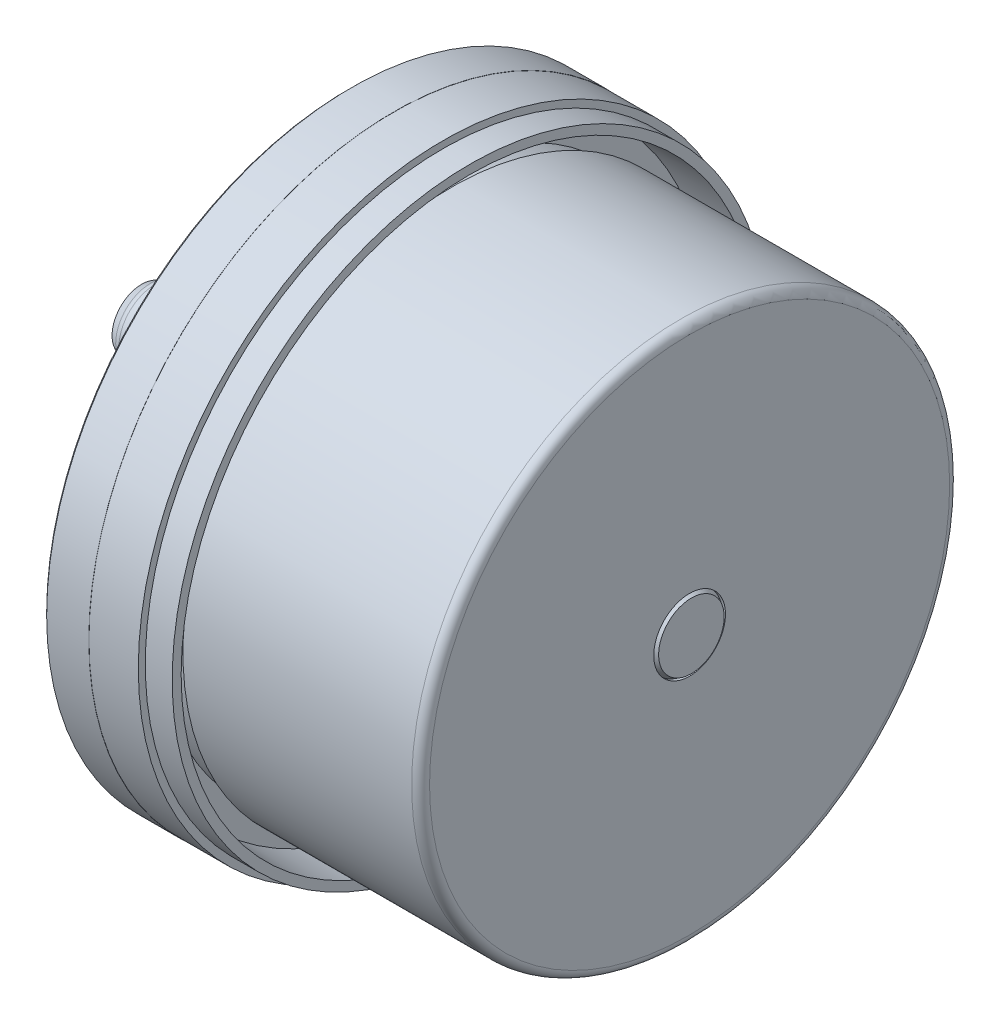
ISO-10303-21;
HEADER;
FILE_DESCRIPTION(('STEP AP214'),'2;1');
FILE_NAME('part.step','',(''),(''),'','','');
FILE_SCHEMA(('AUTOMOTIVE_DESIGN { 1 0 10303 214 1 1 1 1 }'));
ENDSEC;
DATA;
#1=APPLICATION_CONTEXT('core data for automotive mechanical design processes');
#2=APPLICATION_PROTOCOL_DEFINITION('international standard','automotive_design',2000,#1);
#3=PRODUCT_CONTEXT('',#1,'mechanical');
#4=PRODUCT('Part','Part','',(#3));
#5=PRODUCT_RELATED_PRODUCT_CATEGORY('part','',(#4));
#6=PRODUCT_DEFINITION_FORMATION('','',#4);
#7=PRODUCT_DEFINITION_CONTEXT('part definition',#1,'design');
#8=PRODUCT_DEFINITION('design','',#6,#7);
#9=PRODUCT_DEFINITION_SHAPE('','',#8);
#10=(LENGTH_UNIT() NAMED_UNIT(*) SI_UNIT(.MILLI.,.METRE.));
#11=(NAMED_UNIT(*) PLANE_ANGLE_UNIT() SI_UNIT($,.RADIAN.));
#12=(NAMED_UNIT(*) SI_UNIT($,.STERADIAN.) SOLID_ANGLE_UNIT());
#13=UNCERTAINTY_MEASURE_WITH_UNIT(LENGTH_MEASURE(1.E-05),#10,'distance_accuracy_value','');
#14=(GEOMETRIC_REPRESENTATION_CONTEXT(3) GLOBAL_UNCERTAINTY_ASSIGNED_CONTEXT((#13)) GLOBAL_UNIT_ASSIGNED_CONTEXT((#10,
#11,#12)) REPRESENTATION_CONTEXT('',''));
#15=CARTESIAN_POINT('',(0.,0.,0.));
#16=DIRECTION('',(0.,0.,1.));
#17=DIRECTION('',(1.,0.,0.));
#18=AXIS2_PLACEMENT_3D('',#15,#16,#17);
#19=CARTESIAN_POINT('',(-21.8999999999602,-8.96647078790032E-12,0.));
#20=DIRECTION('',(1.,0.,0.));
#21=DIRECTION('',(0.,0.,-1.));
#22=AXIS2_PLACEMENT_3D('',#19,#20,#21);
#23=CONICAL_SURFACE('',#22,4.00000000000897,0.523598775598299);
#24=CARTESIAN_POINT('',(-22.1320508075291,-8.96647078790032E-12,0.));
#25=DIRECTION('',(-1.,0.,0.));
#26=DIRECTION('',(0.,0.,1.));
#27=AXIS2_PLACEMENT_3D('',#24,#25,#26);
#28=CIRCLE('',#27,3.86602540379341);
#29=CARTESIAN_POINT('',(-22.1320508075291,-8.96647078790032E-12,3.86602540379341));
#30=VERTEX_POINT('',#29);
#31=EDGE_CURVE('E13',#30,#30,#28,.T.);
#32=ORIENTED_EDGE('',*,*,#31,.T.);
#33=EDGE_LOOP('',(#32));
#34=FACE_BOUND('',#33,.T.);
#35=CARTESIAN_POINT('',(-23.0999999999374,-8.96647078790032E-12,0.));
#36=DIRECTION('',(1.,0.,0.));
#37=DIRECTION('',(0.,0.,-1.));
#38=AXIS2_PLACEMENT_3D('',#35,#36,#37);
#39=CIRCLE('',#38,3.30717967699457);
#40=CARTESIAN_POINT('',(-23.0999999999374,-8.96647078790032E-12,-3.30717967699457));
#41=VERTEX_POINT('',#40);
#42=EDGE_CURVE('E131',#41,#41,#39,.T.);
#43=ORIENTED_EDGE('',*,*,#42,.T.);
#44=EDGE_LOOP('',(#43));
#45=FACE_BOUND('',#44,.T.);
#46=ADVANCED_FACE('F44',(#34,#45),#23,.T.);
#47=CARTESIAN_POINT('',(-23.0999999999374,3.3071796769856,0.));
#48=DIRECTION('',(-1.,0.,0.));
#49=DIRECTION('',(0.,0.,1.));
#50=AXIS2_PLACEMENT_3D('',#47,#48,#49);
#51=PLANE('',#50);
#52=ORIENTED_EDGE('',*,*,#42,.F.);
#53=EDGE_LOOP('',(#52));
#54=FACE_BOUND('',#53,.T.);
#55=ADVANCED_FACE('F185',(#54),#51,.T.);
#56=CARTESIAN_POINT('',(38.2000000000212,-8.96647078790032E-12,0.));
#57=DIRECTION('',(1.,0.,0.));
#58=DIRECTION('',(0.,0.,-1.));
#59=AXIS2_PLACEMENT_3D('',#56,#57,#58);
#60=PLANE('',#59);
#61=CARTESIAN_POINT('',(38.2000000000212,-8.96647078790032E-12,0.));
#62=DIRECTION('',(1.,0.,0.));
#63=DIRECTION('',(0.,0.,-1.));
#64=AXIS2_PLACEMENT_3D('',#61,#62,#63);
#65=CIRCLE('',#64,3.65358983848293);
#66=CARTESIAN_POINT('',(38.2000000000212,-8.96647078790032E-12,-3.65358983848293));
#67=VERTEX_POINT('',#66);
#68=EDGE_CURVE('E128',#67,#67,#65,.T.);
#69=ORIENTED_EDGE('',*,*,#68,.T.);
#70=EDGE_LOOP('',(#69));
#71=FACE_BOUND('',#70,.T.);
#72=ADVANCED_FACE('F191',(#71),#60,.T.);
#73=CARTESIAN_POINT('',(38.2000000000212,-8.96647078790032E-12,0.));
#74=DIRECTION('',(-1.,0.,0.));
#75=DIRECTION('',(0.,0.,1.));
#76=AXIS2_PLACEMENT_3D('',#73,#74,#75);
#77=CONICAL_SURFACE('',#76,3.65358983848293,0.52359877559829);
#78=CARTESIAN_POINT('',(37.6,-8.96647078790032E-12,0.));
#79=DIRECTION('',(1.,0.,0.));
#80=DIRECTION('',(0.,0.,-1.));
#81=AXIS2_PLACEMENT_3D('',#78,#79,#80);
#82=CIRCLE('',#81,4.00000000000897);
#83=CARTESIAN_POINT('',(37.6,-8.96647078790032E-12,-4.00000000000897));
#84=VERTEX_POINT('',#83);
#85=EDGE_CURVE('E125',#84,#84,#82,.T.);
#86=ORIENTED_EDGE('',*,*,#85,.T.);
#87=EDGE_LOOP('',(#86));
#88=FACE_BOUND('',#87,.T.);
#89=ORIENTED_EDGE('',*,*,#68,.F.);
#90=EDGE_LOOP('',(#89));
#91=FACE_BOUND('',#90,.T.);
#92=ADVANCED_FACE('F293',(#88,#91),#77,.T.);
#93=CARTESIAN_POINT('',(-23.0999999999374,-8.96647078790032E-12,0.));
#94=DIRECTION('',(1.,0.,0.));
#95=DIRECTION('',(0.,0.,-1.));
#96=AXIS2_PLACEMENT_3D('',#93,#94,#95);
#97=CYLINDRICAL_SURFACE('',#96,4.00000000000897);
#98=CARTESIAN_POINT('',(38.,-8.96647078790032E-12,0.));
#99=DIRECTION('',(1.,0.,0.));
#100=DIRECTION('',(0.,0.,-1.));
#101=AXIS2_PLACEMENT_3D('',#98,#99,#100);
#102=CIRCLE('',#101,4.00000000000897);
#103=CARTESIAN_POINT('',(38.,-8.96647078790032E-12,-4.00000000000897));
#104=VERTEX_POINT('',#103);
#105=EDGE_CURVE('E122',#104,#104,#102,.T.);
#106=ORIENTED_EDGE('',*,*,#105,.T.);
#107=EDGE_LOOP('',(#106));
#108=FACE_BOUND('',#107,.T.);
#109=ORIENTED_EDGE('',*,*,#85,.F.);
#110=EDGE_LOOP('',(#109));
#111=FACE_BOUND('',#110,.T.);
#112=ADVANCED_FACE('F289',(#108,#111),#97,.F.);
#113=CARTESIAN_POINT('',(38.,4.,0.));
#114=DIRECTION('',(1.,0.,0.));
#115=DIRECTION('',(0.,0.,-1.));
#116=AXIS2_PLACEMENT_3D('',#113,#114,#115);
#117=PLANE('',#116);
#118=CARTESIAN_POINT('',(38.,-8.96647078790032E-12,0.));
#119=DIRECTION('',(1.,0.,0.));
#120=DIRECTION('',(0.,0.,-1.));
#121=AXIS2_PLACEMENT_3D('',#118,#119,#120);
#122=CIRCLE('',#121,29.000000000007);
#123=CARTESIAN_POINT('',(38.,-8.96647078790032E-12,-29.000000000007));
#124=VERTEX_POINT('',#123);
#125=EDGE_CURVE('E164',#124,#124,#122,.T.);
#126=ORIENTED_EDGE('',*,*,#125,.T.);
#127=EDGE_LOOP('',(#126));
#128=FACE_BOUND('',#127,.T.);
#129=ORIENTED_EDGE('',*,*,#105,.F.);
#130=EDGE_LOOP('',(#129));
#131=FACE_BOUND('',#130,.T.);
#132=ADVANCED_FACE('F285',(#128,#131),#117,.T.);
#133=CARTESIAN_POINT('',(-23.0999999999374,-8.96647078790032E-12,0.));
#134=DIRECTION('',(1.,0.,0.));
#135=DIRECTION('',(0.,0.,-1.));
#136=AXIS2_PLACEMENT_3D('',#133,#134,#135);
#137=CYLINDRICAL_SURFACE('',#136,30.000000000007);
#138=CARTESIAN_POINT('',(37.,-8.96647078790032E-12,0.));
#139=DIRECTION('',(1.,0.,0.));
#140=DIRECTION('',(0.,0.,-1.));
#141=AXIS2_PLACEMENT_3D('',#138,#139,#140);
#142=CIRCLE('',#141,30.000000000007);
#143=CARTESIAN_POINT('',(37.,-8.96647078790032E-12,-30.000000000007));
#144=VERTEX_POINT('',#143);
#145=EDGE_CURVE('E167',#144,#144,#142,.F.);
#146=ORIENTED_EDGE('',*,*,#145,.T.);
#147=EDGE_LOOP('',(#146));
#148=FACE_BOUND('',#147,.T.);
#149=CARTESIAN_POINT('',(11.5000000000033,-8.96647078790032E-12,0.));
#150=DIRECTION('',(1.,0.,0.));
#151=DIRECTION('',(0.,0.,-1.));
#152=AXIS2_PLACEMENT_3D('',#149,#150,#151);
#153=CIRCLE('',#152,30.000000000007);
#154=CARTESIAN_POINT('',(11.5000000000033,-8.96647078790032E-12,-30.000000000007));
#155=VERTEX_POINT('',#154);
#156=EDGE_CURVE('E119',#155,#155,#153,.T.);
#157=ORIENTED_EDGE('',*,*,#156,.T.);
#158=EDGE_LOOP('',(#157));
#159=FACE_BOUND('',#158,.T.);
#160=ADVANCED_FACE('F281',(#148,#159),#137,.T.);
#161=CARTESIAN_POINT('',(11.5000000000033,29.9999999999981,0.));
#162=DIRECTION('',(-1.,0.,0.));
#163=DIRECTION('',(0.,0.,1.));
#164=AXIS2_PLACEMENT_3D('',#161,#162,#163);
#165=PLANE('',#164);
#166=CARTESIAN_POINT('',(11.5000000000033,-8.96647078790032E-12,0.));
#167=DIRECTION('',(1.,0.,0.));
#168=DIRECTION('',(0.,0.,-1.));
#169=AXIS2_PLACEMENT_3D('',#166,#167,#168);
#170=CIRCLE('',#169,29.000000000007);
#171=CARTESIAN_POINT('',(11.5000000000033,-8.96647078790032E-12,-29.000000000007));
#172=VERTEX_POINT('',#171);
#173=EDGE_CURVE('E116',#172,#172,#170,.T.);
#174=ORIENTED_EDGE('',*,*,#173,.T.);
#175=EDGE_LOOP('',(#174));
#176=FACE_BOUND('',#175,.T.);
#177=ORIENTED_EDGE('',*,*,#156,.F.);
#178=EDGE_LOOP('',(#177));
#179=FACE_BOUND('',#178,.T.);
#180=ADVANCED_FACE('F277',(#176,#179),#165,.T.);
#181=CARTESIAN_POINT('',(-23.0999999999374,-8.96647078790032E-12,0.));
#182=DIRECTION('',(1.,0.,0.));
#183=DIRECTION('',(0.,0.,-1.));
#184=AXIS2_PLACEMENT_3D('',#181,#182,#183);
#185=CYLINDRICAL_SURFACE('',#184,29.000000000007);
#186=CARTESIAN_POINT('',(7.80000000000329,-8.96647078790032E-12,0.));
#187=DIRECTION('',(1.,0.,0.));
#188=DIRECTION('',(0.,0.,-1.));
#189=AXIS2_PLACEMENT_3D('',#186,#187,#188);
#190=CIRCLE('',#189,29.000000000007);
#191=CARTESIAN_POINT('',(7.80000000000329,-8.96647078790032E-12,-29.000000000007));
#192=VERTEX_POINT('',#191);
#193=EDGE_CURVE('E113',#192,#192,#190,.T.);
#194=ORIENTED_EDGE('',*,*,#193,.T.);
#195=EDGE_LOOP('',(#194));
#196=FACE_BOUND('',#195,.T.);
#197=ORIENTED_EDGE('',*,*,#173,.F.);
#198=EDGE_LOOP('',(#197));
#199=FACE_BOUND('',#198,.T.);
#200=ADVANCED_FACE('F273',(#196,#199),#185,.T.);
#201=CARTESIAN_POINT('',(7.80000000000329,28.9999999999981,0.));
#202=DIRECTION('',(1.,0.,0.));
#203=DIRECTION('',(0.,0.,-1.));
#204=AXIS2_PLACEMENT_3D('',#201,#202,#203);
#205=PLANE('',#204);
#206=CARTESIAN_POINT('',(7.80000000000329,-8.96647078790032E-12,0.));
#207=DIRECTION('',(1.,0.,0.));
#208=DIRECTION('',(0.,0.,-1.));
#209=AXIS2_PLACEMENT_3D('',#206,#207,#208);
#210=CIRCLE('',#209,32.0009516139056);
#211=CARTESIAN_POINT('',(7.80000000000329,-8.96647078790032E-12,-32.0009516139056));
#212=VERTEX_POINT('',#211);
#213=EDGE_CURVE('E110',#212,#212,#210,.T.);
#214=ORIENTED_EDGE('',*,*,#213,.T.);
#215=EDGE_LOOP('',(#214));
#216=FACE_BOUND('',#215,.T.);
#217=ORIENTED_EDGE('',*,*,#193,.F.);
#218=EDGE_LOOP('',(#217));
#219=FACE_BOUND('',#218,.T.);
#220=ADVANCED_FACE('F269',(#216,#219),#205,.T.);
#221=CARTESIAN_POINT('',(7.80000000000329,-8.96647078790032E-12,0.));
#222=DIRECTION('',(1.,0.,0.));
#223=DIRECTION('',(0.,0.,-1.));
#224=AXIS2_PLACEMENT_3D('',#221,#222,#223);
#225=CONICAL_SURFACE('',#224,32.0009516139056,0.0349065850398798);
#226=CARTESIAN_POINT('',(13.5000000000032,-8.96647078790032E-12,0.));
#227=DIRECTION('',(1.,0.,0.));
#228=DIRECTION('',(0.,0.,-1.));
#229=AXIS2_PLACEMENT_3D('',#226,#227,#228);
#230=CIRCLE('',#229,32.2000000000085);
#231=CARTESIAN_POINT('',(13.5000000000032,-8.96647078790032E-12,-32.2000000000085));
#232=VERTEX_POINT('',#231);
#233=EDGE_CURVE('E107',#232,#232,#230,.T.);
#234=ORIENTED_EDGE('',*,*,#233,.T.);
#235=EDGE_LOOP('',(#234));
#236=FACE_BOUND('',#235,.T.);
#237=ORIENTED_EDGE('',*,*,#213,.F.);
#238=EDGE_LOOP('',(#237));
#239=FACE_BOUND('',#238,.T.);
#240=ADVANCED_FACE('F265',(#236,#239),#225,.F.);
#241=CARTESIAN_POINT('',(13.5000000000032,32.1999999999995,0.));
#242=DIRECTION('',(1.,0.,0.));
#243=DIRECTION('',(0.,0.,-1.));
#244=AXIS2_PLACEMENT_3D('',#241,#242,#243);
#245=PLANE('',#244);
#246=CARTESIAN_POINT('',(13.5000000000032,-8.96647078790032E-12,0.));
#247=DIRECTION('',(1.,0.,0.));
#248=DIRECTION('',(0.,0.,-1.));
#249=AXIS2_PLACEMENT_3D('',#246,#247,#248);
#250=CIRCLE('',#249,33.200000000007);
#251=CARTESIAN_POINT('',(13.5000000000032,-8.96647078790032E-12,-33.200000000007));
#252=VERTEX_POINT('',#251);
#253=EDGE_CURVE('E104',#252,#252,#250,.T.);
#254=ORIENTED_EDGE('',*,*,#253,.T.);
#255=EDGE_LOOP('',(#254));
#256=FACE_BOUND('',#255,.T.);
#257=ORIENTED_EDGE('',*,*,#233,.F.);
#258=EDGE_LOOP('',(#257));
#259=FACE_BOUND('',#258,.T.);
#260=ADVANCED_FACE('F261',(#256,#259),#245,.T.);
#261=CARTESIAN_POINT('',(-23.0999999999374,-8.96647078790032E-12,0.));
#262=DIRECTION('',(1.,0.,0.));
#263=DIRECTION('',(0.,0.,-1.));
#264=AXIS2_PLACEMENT_3D('',#261,#262,#263);
#265=CYLINDRICAL_SURFACE('',#264,33.200000000007);
#266=CARTESIAN_POINT('',(10.5000000000032,-8.96647078790032E-12,0.));
#267=DIRECTION('',(1.,0.,0.));
#268=DIRECTION('',(0.,0.,-1.));
#269=AXIS2_PLACEMENT_3D('',#266,#267,#268);
#270=CIRCLE('',#269,33.2000000000071);
#271=CARTESIAN_POINT('',(10.5000000000032,-8.96647078790032E-12,-33.2000000000071));
#272=VERTEX_POINT('',#271);
#273=EDGE_CURVE('E101',#272,#272,#270,.T.);
#274=ORIENTED_EDGE('',*,*,#273,.T.);
#275=EDGE_LOOP('',(#274));
#276=FACE_BOUND('',#275,.T.);
#277=ORIENTED_EDGE('',*,*,#253,.F.);
#278=EDGE_LOOP('',(#277));
#279=FACE_BOUND('',#278,.T.);
#280=ADVANCED_FACE('F257',(#276,#279),#265,.T.);
#281=CARTESIAN_POINT('',(10.5000000000032,33.1999999999981,0.));
#282=DIRECTION('',(1.,0.,0.));
#283=DIRECTION('',(0.,0.,-1.));
#284=AXIS2_PLACEMENT_3D('',#281,#282,#283);
#285=PLANE('',#284);
#286=CARTESIAN_POINT('',(10.5000000000032,-8.96647078790032E-12,0.));
#287=DIRECTION('',(1.,0.,0.));
#288=DIRECTION('',(0.,0.,-1.));
#289=AXIS2_PLACEMENT_3D('',#286,#287,#288);
#290=CIRCLE('',#289,33.980000000007);
#291=CARTESIAN_POINT('',(10.5000000000032,-8.96647078790032E-12,-33.980000000007));
#292=VERTEX_POINT('',#291);
#293=EDGE_CURVE('E98',#292,#292,#290,.T.);
#294=ORIENTED_EDGE('',*,*,#293,.T.);
#295=EDGE_LOOP('',(#294));
#296=FACE_BOUND('',#295,.T.);
#297=ORIENTED_EDGE('',*,*,#273,.F.);
#298=EDGE_LOOP('',(#297));
#299=FACE_BOUND('',#298,.T.);
#300=ADVANCED_FACE('F253',(#296,#299),#285,.T.);
#301=CARTESIAN_POINT('',(-23.0999999999374,-8.96647078790032E-12,0.));
#302=DIRECTION('',(1.,0.,0.));
#303=DIRECTION('',(0.,0.,-1.));
#304=AXIS2_PLACEMENT_3D('',#301,#302,#303);
#305=CYLINDRICAL_SURFACE('',#304,33.980000000007);
#306=CARTESIAN_POINT('',(5.00000000000322,-8.96647078790032E-12,0.));
#307=DIRECTION('',(1.,0.,0.));
#308=DIRECTION('',(0.,0.,-1.));
#309=AXIS2_PLACEMENT_3D('',#306,#307,#308);
#310=CIRCLE('',#309,33.980000000007);
#311=CARTESIAN_POINT('',(5.00000000000322,-8.96647078790032E-12,-33.980000000007));
#312=VERTEX_POINT('',#311);
#313=EDGE_CURVE('E95',#312,#312,#310,.T.);
#314=ORIENTED_EDGE('',*,*,#313,.T.);
#315=EDGE_LOOP('',(#314));
#316=FACE_BOUND('',#315,.T.);
#317=ORIENTED_EDGE('',*,*,#293,.F.);
#318=EDGE_LOOP('',(#317));
#319=FACE_BOUND('',#318,.T.);
#320=ADVANCED_FACE('F249',(#316,#319),#305,.T.);
#321=CARTESIAN_POINT('',(5.00000000000322,33.9799999999981,0.));
#322=DIRECTION('',(1.,0.,0.));
#323=DIRECTION('',(0.,0.,-1.));
#324=AXIS2_PLACEMENT_3D('',#321,#322,#323);
#325=PLANE('',#324);
#326=CARTESIAN_POINT('',(5.00000000000322,-8.96647078790032E-12,0.));
#327=DIRECTION('',(1.,0.,0.));
#328=DIRECTION('',(0.,0.,-1.));
#329=AXIS2_PLACEMENT_3D('',#326,#327,#328);
#330=CIRCLE('',#329,34.000000000007);
#331=CARTESIAN_POINT('',(5.00000000000322,-8.96647078790032E-12,-34.000000000007));
#332=VERTEX_POINT('',#331);
#333=EDGE_CURVE('E92',#332,#332,#330,.T.);
#334=ORIENTED_EDGE('',*,*,#333,.T.);
#335=EDGE_LOOP('',(#334));
#336=FACE_BOUND('',#335,.T.);
#337=ORIENTED_EDGE('',*,*,#313,.F.);
#338=EDGE_LOOP('',(#337));
#339=FACE_BOUND('',#338,.T.);
#340=ADVANCED_FACE('F242',(#336,#339),#325,.T.);
#341=CARTESIAN_POINT('',(-23.0999999999374,-8.96647078790032E-12,0.));
#342=DIRECTION('',(1.,0.,0.));
#343=DIRECTION('',(0.,0.,-1.));
#344=AXIS2_PLACEMENT_3D('',#341,#342,#343);
#345=CYLINDRICAL_SURFACE('',#344,34.000000000007);
#346=CARTESIAN_POINT('',(0.300000000003332,-8.96647078790032E-12,0.));
#347=DIRECTION('',(-1.,0.,0.));
#348=DIRECTION('',(0.,0.,1.));
#349=AXIS2_PLACEMENT_3D('',#346,#347,#348);
#350=CIRCLE('',#349,34.000000000007);
#351=CARTESIAN_POINT('',(0.300000000003332,-8.96647078790032E-12,34.000000000007));
#352=VERTEX_POINT('',#351);
#353=EDGE_CURVE('E152',#352,#352,#350,.F.);
#354=ORIENTED_EDGE('',*,*,#353,.T.);
#355=EDGE_LOOP('',(#354));
#356=FACE_BOUND('',#355,.T.);
#357=ORIENTED_EDGE('',*,*,#333,.F.);
#358=EDGE_LOOP('',(#357));
#359=FACE_BOUND('',#358,.T.);
#360=ADVANCED_FACE('F236',(#356,#359),#345,.T.);
#361=CARTESIAN_POINT('',(3.21835627661152E-12,33.9999999999981,0.));
#362=DIRECTION('',(-1.,0.,0.));
#363=DIRECTION('',(0.,0.,1.));
#364=AXIS2_PLACEMENT_3D('',#361,#362,#363);
#365=PLANE('',#364);
#366=CARTESIAN_POINT('',(3.21835627661152E-12,-8.96647078790032E-12,0.));
#367=DIRECTION('',(-1.,0.,0.));
#368=DIRECTION('',(0.,0.,1.));
#369=AXIS2_PLACEMENT_3D('',#366,#367,#368);
#370=CIRCLE('',#369,33.700000000007);
#371=CARTESIAN_POINT('',(3.21835627661152E-12,-8.96647078790032E-12,33.700000000007));
#372=VERTEX_POINT('',#371);
#373=EDGE_CURVE('E155',#372,#372,#370,.T.);
#374=ORIENTED_EDGE('',*,*,#373,.T.);
#375=EDGE_LOOP('',(#374));
#376=FACE_BOUND('',#375,.T.);
#377=CARTESIAN_POINT('',(3.21835627661152E-12,21.5,0.));
#378=DIRECTION('',(-1.,0.,0.));
#379=DIRECTION('',(0.,0.,1.));
#380=AXIS2_PLACEMENT_3D('',#377,#378,#379);
#381=CIRCLE('',#380,2.20000000009175);
#382=CARTESIAN_POINT('',(3.21835627661152E-12,21.5,2.20000000009175));
#383=VERTEX_POINT('',#382);
#384=EDGE_CURVE('E143',#383,#383,#381,.F.);
#385=ORIENTED_EDGE('',*,*,#384,.T.);
#386=EDGE_LOOP('',(#385));
#387=FACE_BOUND('',#386,.T.);
#388=CARTESIAN_POINT('',(3.21835627661152E-12,-10.75,18.61954618137));
#389=DIRECTION('',(-1.,0.,0.));
#390=DIRECTION('',(0.,0.,1.));
#391=AXIS2_PLACEMENT_3D('',#388,#389,#390);
#392=CIRCLE('',#391,2.20000000009175);
#393=CARTESIAN_POINT('',(3.21835627661152E-12,-10.75,20.8195461814618));
#394=VERTEX_POINT('',#393);
#395=EDGE_CURVE('E140',#394,#394,#392,.F.);
#396=ORIENTED_EDGE('',*,*,#395,.T.);
#397=EDGE_LOOP('',(#396));
#398=FACE_BOUND('',#397,.T.);
#399=CARTESIAN_POINT('',(3.21835627661152E-12,-10.75,-18.61954618137));
#400=DIRECTION('',(-1.,0.,0.));
#401=DIRECTION('',(0.,0.,1.));
#402=AXIS2_PLACEMENT_3D('',#399,#400,#401);
#403=CIRCLE('',#402,2.20000000009175);
#404=CARTESIAN_POINT('',(3.21835627661152E-12,-10.75,-16.4195461812782));
#405=VERTEX_POINT('',#404);
#406=EDGE_CURVE('E137',#405,#405,#403,.F.);
#407=ORIENTED_EDGE('',*,*,#406,.T.);
#408=EDGE_LOOP('',(#407));
#409=FACE_BOUND('',#408,.T.);
#410=CARTESIAN_POINT('',(3.21964677141295E-12,-8.96647078790032E-12,0.));
#411=DIRECTION('',(1.,0.,0.));
#412=DIRECTION('',(0.,0.,-1.));
#413=AXIS2_PLACEMENT_3D('',#410,#411,#412);
#414=CIRCLE('',#413,11.2886751346026);
#415=CARTESIAN_POINT('',(3.21964677141295E-12,-8.96647078790032E-12,-11.2886751346026));
#416=VERTEX_POINT('',#415);
#417=EDGE_CURVE('E89',#416,#416,#414,.T.);
#418=ORIENTED_EDGE('',*,*,#417,.T.);
#419=EDGE_LOOP('',(#418));
#420=FACE_BOUND('',#419,.T.);
#421=ADVANCED_FACE('F231',(#376,#387,#398,#409,#420),#365,.T.);
#422=CARTESIAN_POINT('',(3.21964677141295E-12,-8.96647078790032E-12,0.));
#423=DIRECTION('',(-1.,0.,0.));
#424=DIRECTION('',(0.,0.,1.));
#425=AXIS2_PLACEMENT_3D('',#422,#423,#424);
#426=CONICAL_SURFACE('',#425,11.2886751346026,0.523598775598298);
#427=CARTESIAN_POINT('',(0.500000000001138,-8.96647078790032E-12,0.));
#428=DIRECTION('',(1.,0.,0.));
#429=DIRECTION('',(0.,0.,-1.));
#430=AXIS2_PLACEMENT_3D('',#427,#428,#429);
#431=CIRCLE('',#430,11.000000000009);
#432=CARTESIAN_POINT('',(0.500000000001138,-8.96647078790032E-12,-11.000000000009));
#433=VERTEX_POINT('',#432);
#434=EDGE_CURVE('E86',#433,#433,#431,.T.);
#435=ORIENTED_EDGE('',*,*,#434,.T.);
#436=EDGE_LOOP('',(#435));
#437=FACE_BOUND('',#436,.T.);
#438=ORIENTED_EDGE('',*,*,#417,.F.);
#439=EDGE_LOOP('',(#438));
#440=FACE_BOUND('',#439,.T.);
#441=ADVANCED_FACE('F225',(#437,#440),#426,.F.);
#442=CARTESIAN_POINT('',(-23.0999999999374,-8.96647078790032E-12,0.));
#443=DIRECTION('',(1.,0.,0.));
#444=DIRECTION('',(0.,0.,-1.));
#445=AXIS2_PLACEMENT_3D('',#442,#443,#444);
#446=CYLINDRICAL_SURFACE('',#445,11.000000000009);
#447=CARTESIAN_POINT('',(-2.1,-8.96647078790032E-12,0.));
#448=DIRECTION('',(-1.,0.,0.));
#449=DIRECTION('',(0.,0.,1.));
#450=AXIS2_PLACEMENT_3D('',#447,#448,#449);
#451=CIRCLE('',#450,11.000000000009);
#452=CARTESIAN_POINT('',(-2.1,-8.96647078790032E-12,11.000000000009));
#453=VERTEX_POINT('',#452);
#454=EDGE_CURVE('E158',#453,#453,#451,.F.);
#455=ORIENTED_EDGE('',*,*,#454,.T.);
#456=EDGE_LOOP('',(#455));
#457=FACE_BOUND('',#456,.T.);
#458=ORIENTED_EDGE('',*,*,#434,.F.);
#459=EDGE_LOOP('',(#458));
#460=FACE_BOUND('',#459,.T.);
#461=ADVANCED_FACE('F221',(#457,#460),#446,.T.);
#462=CARTESIAN_POINT('',(-2.6,11.,0.));
#463=DIRECTION('',(-1.,0.,0.));
#464=DIRECTION('',(0.,0.,1.));
#465=AXIS2_PLACEMENT_3D('',#462,#463,#464);
#466=PLANE('',#465);
#467=CARTESIAN_POINT('',(-2.6,-8.96647078790032E-12,0.));
#468=DIRECTION('',(-1.,0.,0.));
#469=DIRECTION('',(0.,0.,1.));
#470=AXIS2_PLACEMENT_3D('',#467,#468,#469);
#471=CIRCLE('',#470,10.500000000009);
#472=CARTESIAN_POINT('',(-2.6,-8.96647078790032E-12,10.500000000009));
#473=VERTEX_POINT('',#472);
#474=EDGE_CURVE('E161',#473,#473,#471,.T.);
#475=ORIENTED_EDGE('',*,*,#474,.T.);
#476=EDGE_LOOP('',(#475));
#477=FACE_BOUND('',#476,.T.);
#478=CARTESIAN_POINT('',(-2.6,-8.96647078790032E-12,0.));
#479=DIRECTION('',(1.,0.,0.));
#480=DIRECTION('',(0.,0.,-1.));
#481=AXIS2_PLACEMENT_3D('',#478,#479,#480);
#482=CIRCLE('',#481,4.50000000000897);
#483=CARTESIAN_POINT('',(-2.6,-8.96647078790032E-12,-4.50000000000897));
#484=VERTEX_POINT('',#483);
#485=EDGE_CURVE('E83',#484,#484,#482,.T.);
#486=ORIENTED_EDGE('',*,*,#485,.T.);
#487=EDGE_LOOP('',(#486));
#488=FACE_BOUND('',#487,.T.);
#489=ADVANCED_FACE('F224',(#477,#488),#466,.T.);
#490=CARTESIAN_POINT('',(-2.1,-8.96678564732412E-12,0.));
#491=DIRECTION('',(1.,0.,0.));
#492=DIRECTION('',(0.,0.,-1.));
#493=AXIS2_PLACEMENT_3D('',#490,#491,#492);
#494=TOROIDAL_SURFACE('',#493,4.50000000000897,0.5);
#495=CARTESIAN_POINT('',(-2.1,-8.96647078790032E-12,0.));
#496=DIRECTION('',(1.,0.,0.));
#497=DIRECTION('',(0.,0.,-1.));
#498=AXIS2_PLACEMENT_3D('',#495,#496,#497);
#499=CIRCLE('',#498,4.00000000000897);
#500=CARTESIAN_POINT('',(-2.1,-8.96647078790032E-12,-4.00000000000897));
#501=VERTEX_POINT('',#500);
#502=EDGE_CURVE('E80',#501,#501,#499,.T.);
#503=ORIENTED_EDGE('',*,*,#502,.T.);
#504=EDGE_LOOP('',(#503));
#505=FACE_BOUND('',#504,.T.);
#506=ORIENTED_EDGE('',*,*,#485,.F.);
#507=EDGE_LOOP('',(#506));
#508=FACE_BOUND('',#507,.T.);
#509=ADVANCED_FACE('F393',(#505,#508),#494,.T.);
#510=CARTESIAN_POINT('',(-23.0999999999374,-8.96647078790032E-12,0.));
#511=DIRECTION('',(1.,0.,0.));
#512=DIRECTION('',(0.,0.,-1.));
#513=AXIS2_PLACEMENT_3D('',#510,#511,#512);
#514=CYLINDRICAL_SURFACE('',#513,4.00000000000897);
#515=CARTESIAN_POINT('',(-21.6320508075291,-8.96647078790032E-12,0.));
#516=DIRECTION('',(-1.,0.,0.));
#517=DIRECTION('',(0.,0.,1.));
#518=AXIS2_PLACEMENT_3D('',#515,#516,#517);
#519=CIRCLE('',#518,4.00000000000897);
#520=CARTESIAN_POINT('',(-21.6320508075291,-8.96647078790032E-12,4.00000000000897));
#521=VERTEX_POINT('',#520);
#522=EDGE_CURVE('E52',#521,#521,#519,.F.);
#523=ORIENTED_EDGE('',*,*,#522,.T.);
#524=EDGE_LOOP('',(#523));
#525=FACE_BOUND('',#524,.T.);
#526=ORIENTED_EDGE('',*,*,#502,.F.);
#527=EDGE_LOOP('',(#526));
#528=FACE_BOUND('',#527,.T.);
#529=ADVANCED_FACE('F172',(#525,#528),#514,.T.);
#530=CARTESIAN_POINT('',(7.3,-10.75,-18.61954618137));
#531=DIRECTION('',(-1.,0.,0.));
#532=DIRECTION('',(0.,0.,1.));
#533=AXIS2_PLACEMENT_3D('',#530,#531,#532);
#534=CONICAL_SURFACE('',#533,1.64999999999999,1.02974425866086);
#535=CARTESIAN_POINT('',(8.29142002143094,-10.75,-18.61954618137));
#536=VERTEX_POINT('',#535);
#537=VERTEX_LOOP('',#536);
#538=FACE_BOUND('',#537,.T.);
#539=CARTESIAN_POINT('',(7.3,-10.75,-18.61954618137));
#540=DIRECTION('',(-1.,0.,0.));
#541=DIRECTION('',(0.,0.,1.));
#542=AXIS2_PLACEMENT_3D('',#539,#540,#541);
#543=CIRCLE('',#542,1.64999999999999);
#544=CARTESIAN_POINT('',(7.3,-10.75,-16.96954618137));
#545=VERTEX_POINT('',#544);
#546=EDGE_CURVE('E75',#545,#545,#543,.T.);
#547=ORIENTED_EDGE('',*,*,#546,.T.);
#548=EDGE_LOOP('',(#547));
#549=FACE_BOUND('',#548,.T.);
#550=ADVANCED_FACE('F453',(#538,#549),#534,.F.);
#551=CARTESIAN_POINT('',(0.,-10.75,-18.61954618137));
#552=DIRECTION('',(-1.,0.,0.));
#553=DIRECTION('',(0.,0.,1.));
#554=AXIS2_PLACEMENT_3D('',#551,#552,#553);
#555=CYLINDRICAL_SURFACE('',#554,1.64999999999999);
#556=CARTESIAN_POINT('',(0.550000000076143,-10.75,-18.61954618137));
#557=DIRECTION('',(-1.,0.,0.));
#558=DIRECTION('',(0.,0.,1.));
#559=AXIS2_PLACEMENT_3D('',#556,#557,#558);
#560=CIRCLE('',#559,1.64999999999999);
#561=CARTESIAN_POINT('',(0.550000000076143,-10.75,-16.96954618137));
#562=VERTEX_POINT('',#561);
#563=EDGE_CURVE('E149',#562,#562,#560,.T.);
#564=ORIENTED_EDGE('',*,*,#563,.T.);
#565=EDGE_LOOP('',(#564));
#566=FACE_BOUND('',#565,.T.);
#567=ORIENTED_EDGE('',*,*,#546,.F.);
#568=EDGE_LOOP('',(#567));
#569=FACE_BOUND('',#568,.T.);
#570=ADVANCED_FACE('F465',(#566,#569),#555,.F.);
#571=CARTESIAN_POINT('',(7.3,-10.75,18.61954618137));
#572=DIRECTION('',(-1.,0.,0.));
#573=DIRECTION('',(0.,0.,1.));
#574=AXIS2_PLACEMENT_3D('',#571,#572,#573);
#575=CONICAL_SURFACE('',#574,1.64999999999999,1.02974425866086);
#576=CARTESIAN_POINT('',(8.29142002143094,-10.75,18.61954618137));
#577=VERTEX_POINT('',#576);
#578=VERTEX_LOOP('',#577);
#579=FACE_BOUND('',#578,.T.);
#580=CARTESIAN_POINT('',(7.3,-10.75,18.61954618137));
#581=DIRECTION('',(-1.,0.,0.));
#582=DIRECTION('',(0.,0.,1.));
#583=AXIS2_PLACEMENT_3D('',#580,#581,#582);
#584=CIRCLE('',#583,1.64999999999999);
#585=CARTESIAN_POINT('',(7.3,-10.75,20.26954618137));
#586=VERTEX_POINT('',#585);
#587=EDGE_CURVE('E72',#586,#586,#584,.T.);
#588=ORIENTED_EDGE('',*,*,#587,.T.);
#589=EDGE_LOOP('',(#588));
#590=FACE_BOUND('',#589,.T.);
#591=ADVANCED_FACE('F472',(#579,#590),#575,.F.);
#592=CARTESIAN_POINT('',(0.,-10.75,18.61954618137));
#593=DIRECTION('',(-1.,0.,0.));
#594=DIRECTION('',(0.,0.,1.));
#595=AXIS2_PLACEMENT_3D('',#592,#593,#594);
#596=CYLINDRICAL_SURFACE('',#595,1.64999999999999);
#597=CARTESIAN_POINT('',(0.550000000076143,-10.75,18.61954618137));
#598=DIRECTION('',(-1.,0.,0.));
#599=DIRECTION('',(0.,0.,1.));
#600=AXIS2_PLACEMENT_3D('',#597,#598,#599);
#601=CIRCLE('',#600,1.64999999999999);
#602=CARTESIAN_POINT('',(0.550000000076143,-10.75,20.26954618137));
#603=VERTEX_POINT('',#602);
#604=EDGE_CURVE('E146',#603,#603,#601,.T.);
#605=ORIENTED_EDGE('',*,*,#604,.T.);
#606=EDGE_LOOP('',(#605));
#607=FACE_BOUND('',#606,.T.);
#608=ORIENTED_EDGE('',*,*,#587,.F.);
#609=EDGE_LOOP('',(#608));
#610=FACE_BOUND('',#609,.T.);
#611=ADVANCED_FACE('F66',(#607,#610),#596,.F.);
#612=CARTESIAN_POINT('',(7.3,21.5,0.));
#613=DIRECTION('',(-1.,0.,0.));
#614=DIRECTION('',(0.,0.,1.));
#615=AXIS2_PLACEMENT_3D('',#612,#613,#614);
#616=CONICAL_SURFACE('',#615,1.64999999999999,1.02974425866086);
#617=CARTESIAN_POINT('',(8.29142002143094,21.5,0.));
#618=VERTEX_POINT('',#617);
#619=VERTEX_LOOP('',#618);
#620=FACE_BOUND('',#619,.T.);
#621=CARTESIAN_POINT('',(7.3,21.5,0.));
#622=DIRECTION('',(-1.,0.,0.));
#623=DIRECTION('',(0.,0.,1.));
#624=AXIS2_PLACEMENT_3D('',#621,#622,#623);
#625=CIRCLE('',#624,1.64999999999999);
#626=CARTESIAN_POINT('',(7.3,21.5,1.64999999999999));
#627=VERTEX_POINT('',#626);
#628=EDGE_CURVE('E70',#627,#627,#625,.T.);
#629=ORIENTED_EDGE('',*,*,#628,.T.);
#630=EDGE_LOOP('',(#629));
#631=FACE_BOUND('',#630,.T.);
#632=ADVANCED_FACE('F62',(#620,#631),#616,.F.);
#633=CARTESIAN_POINT('',(0.,21.5,0.));
#634=DIRECTION('',(-1.,0.,0.));
#635=DIRECTION('',(0.,0.,1.));
#636=AXIS2_PLACEMENT_3D('',#633,#634,#635);
#637=CYLINDRICAL_SURFACE('',#636,1.64999999999999);
#638=CARTESIAN_POINT('',(0.550000000076144,21.5,0.));
#639=DIRECTION('',(-1.,0.,0.));
#640=DIRECTION('',(0.,0.,1.));
#641=AXIS2_PLACEMENT_3D('',#638,#639,#640);
#642=CIRCLE('',#641,1.64999999999999);
#643=CARTESIAN_POINT('',(0.550000000076144,21.5,1.64999999999999));
#644=VERTEX_POINT('',#643);
#645=EDGE_CURVE('E134',#644,#644,#642,.T.);
#646=ORIENTED_EDGE('',*,*,#645,.T.);
#647=EDGE_LOOP('',(#646));
#648=FACE_BOUND('',#647,.T.);
#649=ORIENTED_EDGE('',*,*,#628,.F.);
#650=EDGE_LOOP('',(#649));
#651=FACE_BOUND('',#650,.T.);
#652=ADVANCED_FACE('F65',(#648,#651),#637,.F.);
#653=CARTESIAN_POINT('',(0.550000000076144,21.5,0.));
#654=DIRECTION('',(-1.,0.,0.));
#655=DIRECTION('',(0.,0.,1.));
#656=AXIS2_PLACEMENT_3D('',#653,#654,#655);
#657=CONICAL_SURFACE('',#656,1.64999999999999,0.785398163414575);
#658=ORIENTED_EDGE('',*,*,#384,.F.);
#659=EDGE_LOOP('',(#658));
#660=FACE_BOUND('',#659,.T.);
#661=ORIENTED_EDGE('',*,*,#645,.F.);
#662=EDGE_LOOP('',(#661));
#663=FACE_BOUND('',#662,.T.);
#664=ADVANCED_FACE('F197',(#660,#663),#657,.F.);
#665=CARTESIAN_POINT('',(0.550000000076143,-10.75,18.61954618137));
#666=DIRECTION('',(-1.,0.,0.));
#667=DIRECTION('',(0.,0.,1.));
#668=AXIS2_PLACEMENT_3D('',#665,#666,#667);
#669=CONICAL_SURFACE('',#668,1.64999999999999,0.785398163414575);
#670=ORIENTED_EDGE('',*,*,#395,.F.);
#671=EDGE_LOOP('',(#670));
#672=FACE_BOUND('',#671,.T.);
#673=ORIENTED_EDGE('',*,*,#604,.F.);
#674=EDGE_LOOP('',(#673));
#675=FACE_BOUND('',#674,.T.);
#676=ADVANCED_FACE('F200',(#672,#675),#669,.F.);
#677=CARTESIAN_POINT('',(0.550000000076143,-10.75,-18.61954618137));
#678=DIRECTION('',(-1.,0.,0.));
#679=DIRECTION('',(0.,0.,1.));
#680=AXIS2_PLACEMENT_3D('',#677,#678,#679);
#681=CONICAL_SURFACE('',#680,1.64999999999999,0.785398163414575);
#682=ORIENTED_EDGE('',*,*,#406,.F.);
#683=EDGE_LOOP('',(#682));
#684=FACE_BOUND('',#683,.T.);
#685=ORIENTED_EDGE('',*,*,#563,.F.);
#686=EDGE_LOOP('',(#685));
#687=FACE_BOUND('',#686,.T.);
#688=ADVANCED_FACE('F204',(#684,#687),#681,.F.);
#689=CARTESIAN_POINT('',(0.300000000003332,-8.96647078790032E-12,0.));
#690=DIRECTION('',(1.,0.,0.));
#691=DIRECTION('',(0.,0.,-1.));
#692=AXIS2_PLACEMENT_3D('',#689,#690,#691);
#693=CONICAL_SURFACE('',#692,34.000000000007,0.785398163397298);
#694=ORIENTED_EDGE('',*,*,#373,.F.);
#695=EDGE_LOOP('',(#694));
#696=FACE_BOUND('',#695,.T.);
#697=ORIENTED_EDGE('',*,*,#353,.F.);
#698=EDGE_LOOP('',(#697));
#699=FACE_BOUND('',#698,.T.);
#700=ADVANCED_FACE('F208',(#696,#699),#693,.T.);
#701=CARTESIAN_POINT('',(-2.1,-8.96647078790032E-12,0.));
#702=DIRECTION('',(-1.,0.,0.));
#703=DIRECTION('',(0.,0.,1.));
#704=AXIS2_PLACEMENT_3D('',#701,#702,#703);
#705=TOROIDAL_SURFACE('',#704,10.500000000009,0.5);
#706=ORIENTED_EDGE('',*,*,#474,.F.);
#707=EDGE_LOOP('',(#706));
#708=FACE_BOUND('',#707,.T.);
#709=ORIENTED_EDGE('',*,*,#454,.F.);
#710=EDGE_LOOP('',(#709));
#711=FACE_BOUND('',#710,.T.);
#712=ADVANCED_FACE('F181',(#708,#711),#705,.T.);
#713=CARTESIAN_POINT('',(37.,-8.96647078790032E-12,0.));
#714=DIRECTION('',(1.,0.,0.));
#715=DIRECTION('',(0.,0.,-1.));
#716=AXIS2_PLACEMENT_3D('',#713,#714,#715);
#717=TOROIDAL_SURFACE('',#716,29.000000000007,1.);
#718=ORIENTED_EDGE('',*,*,#145,.F.);
#719=EDGE_LOOP('',(#718));
#720=FACE_BOUND('',#719,.T.);
#721=ORIENTED_EDGE('',*,*,#125,.F.);
#722=EDGE_LOOP('',(#721));
#723=FACE_BOUND('',#722,.T.);
#724=ADVANCED_FACE('F176',(#720,#723),#717,.T.);
#725=CARTESIAN_POINT('',(-21.6320508075291,-8.96647078790032E-12,0.));
#726=DIRECTION('',(-1.,0.,0.));
#727=DIRECTION('',(0.,0.,1.));
#728=AXIS2_PLACEMENT_3D('',#725,#726,#727);
#729=TOROIDAL_SURFACE('',#728,3.00000000000897,1.);
#730=ORIENTED_EDGE('',*,*,#31,.F.);
#731=EDGE_LOOP('',(#730));
#732=FACE_BOUND('',#731,.T.);
#733=ORIENTED_EDGE('',*,*,#522,.F.);
#734=EDGE_LOOP('',(#733));
#735=FACE_BOUND('',#734,.T.);
#736=ADVANCED_FACE('F46',(#732,#735),#729,.T.);
#737=CLOSED_SHELL('',(#46,#55,#72,#92,#112,#132,#160,#180,#200,#220,#240,#260,#280,#300,#320,
#340,#360,#421,#441,#461,#489,#509,#529,#550,#570,#591,#611,#632,#652,#664,#676,#688,#700,#712,
#724,#736));
#738=MANIFOLD_SOLID_BREP('B2',#737);
#739=ADVANCED_BREP_SHAPE_REPRESENTATION('',(#18,#738),#14);
#740=SHAPE_DEFINITION_REPRESENTATION(#9,#739);
ENDSEC;
END-ISO-10303-21;
